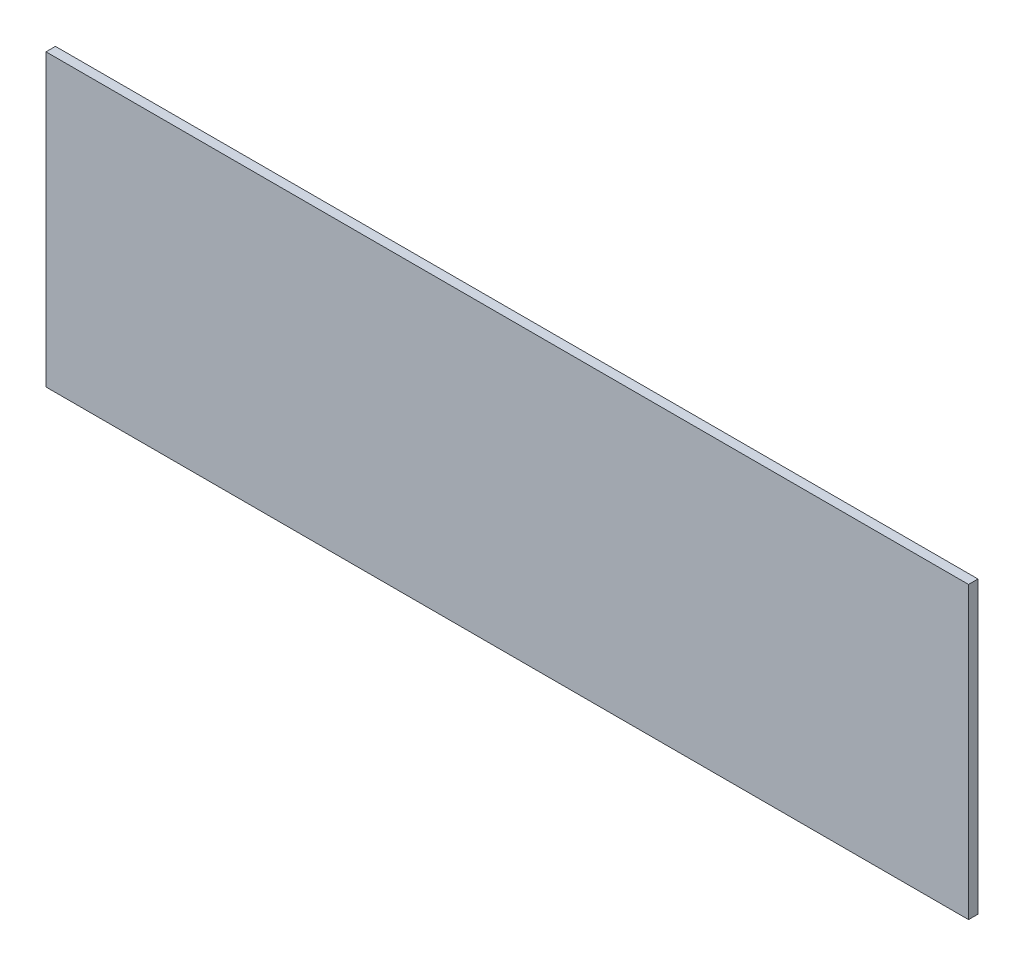
ISO-10303-21;
HEADER;
FILE_DESCRIPTION(('STEP AP214'),'2;1');
FILE_NAME('part.step','',(''),(''),'','','');
FILE_SCHEMA(('AUTOMOTIVE_DESIGN { 1 0 10303 214 1 1 1 1 }'));
ENDSEC;
DATA;
#1=APPLICATION_CONTEXT('core data for automotive mechanical design processes');
#2=APPLICATION_PROTOCOL_DEFINITION('international standard','automotive_design',2000,#1);
#3=PRODUCT_CONTEXT('',#1,'mechanical');
#4=PRODUCT('Part','Part','',(#3));
#5=PRODUCT_RELATED_PRODUCT_CATEGORY('part','',(#4));
#6=PRODUCT_DEFINITION_FORMATION('','',#4);
#7=PRODUCT_DEFINITION_CONTEXT('part definition',#1,'design');
#8=PRODUCT_DEFINITION('design','',#6,#7);
#9=PRODUCT_DEFINITION_SHAPE('','',#8);
#10=(LENGTH_UNIT() NAMED_UNIT(*) SI_UNIT(.MILLI.,.METRE.));
#11=(NAMED_UNIT(*) PLANE_ANGLE_UNIT() SI_UNIT($,.RADIAN.));
#12=(NAMED_UNIT(*) SI_UNIT($,.STERADIAN.) SOLID_ANGLE_UNIT());
#13=UNCERTAINTY_MEASURE_WITH_UNIT(LENGTH_MEASURE(1.E-05),#10,'distance_accuracy_value','');
#14=(GEOMETRIC_REPRESENTATION_CONTEXT(3) GLOBAL_UNCERTAINTY_ASSIGNED_CONTEXT((#13)) GLOBAL_UNIT_ASSIGNED_CONTEXT((#10,
#11,#12)) REPRESENTATION_CONTEXT('',''));
#15=CARTESIAN_POINT('',(0.,0.,0.));
#16=DIRECTION('',(0.,0.,1.));
#17=DIRECTION('',(1.,0.,0.));
#18=AXIS2_PLACEMENT_3D('',#15,#16,#17);
#19=CARTESIAN_POINT('',(73.25,-23.05,1.5));
#20=DIRECTION('',(-1.,0.,0.));
#21=DIRECTION('',(0.,0.,1.));
#22=AXIS2_PLACEMENT_3D('',#19,#20,#21);
#23=PLANE('',#22);
#24=DIRECTION('',(0.,1.,0.));
#25=VECTOR('',#24,1.);
#26=CARTESIAN_POINT('',(73.25,-23.05,0.));
#27=LINE('',#26,#25);
#28=CARTESIAN_POINT('',(73.25,-23.05,0.));
#29=VERTEX_POINT('',#28);
#30=CARTESIAN_POINT('',(73.25,23.05,0.));
#31=VERTEX_POINT('',#30);
#32=EDGE_CURVE('E107',#29,#31,#27,.T.);
#33=ORIENTED_EDGE('',*,*,#32,.T.);
#34=DIRECTION('',(0.,0.,-1.));
#35=VECTOR('',#34,1.);
#36=CARTESIAN_POINT('',(73.25,23.05,1.5));
#37=LINE('',#36,#35);
#38=CARTESIAN_POINT('',(73.25,23.05,1.5));
#39=VERTEX_POINT('',#38);
#40=EDGE_CURVE('E11',#39,#31,#37,.T.);
#41=ORIENTED_EDGE('',*,*,#40,.F.);
#42=DIRECTION('',(0.,1.,0.));
#43=VECTOR('',#42,1.);
#44=CARTESIAN_POINT('',(73.25,-23.05,1.5));
#45=LINE('',#44,#43);
#46=CARTESIAN_POINT('',(73.25,-23.05,1.5));
#47=VERTEX_POINT('',#46);
#48=EDGE_CURVE('E91',#47,#39,#45,.T.);
#49=ORIENTED_EDGE('',*,*,#48,.F.);
#50=DIRECTION('',(0.,0.,-1.));
#51=VECTOR('',#50,1.);
#52=CARTESIAN_POINT('',(73.25,-23.05,1.5));
#53=LINE('',#52,#51);
#54=EDGE_CURVE('E103',#47,#29,#53,.T.);
#55=ORIENTED_EDGE('',*,*,#54,.T.);
#56=EDGE_LOOP('',(#33,#41,#49,#55));
#57=FACE_BOUND('',#56,.T.);
#58=ADVANCED_FACE('F39',(#57),#23,.F.);
#59=CARTESIAN_POINT('',(-73.25,23.05,1.5));
#60=DIRECTION('',(0.,-1.,0.));
#61=DIRECTION('',(0.,0.,-1.));
#62=AXIS2_PLACEMENT_3D('',#59,#60,#61);
#63=PLANE('',#62);
#64=DIRECTION('',(-1.,0.,0.));
#65=VECTOR('',#64,1.);
#66=CARTESIAN_POINT('',(-73.25,23.05,0.));
#67=LINE('',#66,#65);
#68=CARTESIAN_POINT('',(-73.25,23.05,0.));
#69=VERTEX_POINT('',#68);
#70=EDGE_CURVE('E96',#31,#69,#67,.T.);
#71=ORIENTED_EDGE('',*,*,#70,.T.);
#72=DIRECTION('',(0.,0.,-1.));
#73=VECTOR('',#72,1.);
#74=CARTESIAN_POINT('',(-73.25,23.05,1.5));
#75=LINE('',#74,#73);
#76=CARTESIAN_POINT('',(-73.25,23.05,1.5));
#77=VERTEX_POINT('',#76);
#78=EDGE_CURVE('E48',#77,#69,#75,.T.);
#79=ORIENTED_EDGE('',*,*,#78,.F.);
#80=DIRECTION('',(-1.,0.,0.));
#81=VECTOR('',#80,1.);
#82=CARTESIAN_POINT('',(-73.25,23.05,1.5));
#83=LINE('',#82,#81);
#84=EDGE_CURVE('E86',#39,#77,#83,.T.);
#85=ORIENTED_EDGE('',*,*,#84,.F.);
#86=ORIENTED_EDGE('',*,*,#40,.T.);
#87=EDGE_LOOP('',(#71,#79,#85,#86));
#88=FACE_BOUND('',#87,.T.);
#89=ADVANCED_FACE('F95',(#88),#63,.F.);
#90=CARTESIAN_POINT('',(-73.25,-23.05,1.5));
#91=DIRECTION('',(1.,0.,0.));
#92=DIRECTION('',(0.,0.,-1.));
#93=AXIS2_PLACEMENT_3D('',#90,#91,#92);
#94=PLANE('',#93);
#95=DIRECTION('',(0.,-1.,0.));
#96=VECTOR('',#95,1.);
#97=CARTESIAN_POINT('',(-73.25,-23.05,0.));
#98=LINE('',#97,#96);
#99=CARTESIAN_POINT('',(-73.25,-23.05,0.));
#100=VERTEX_POINT('',#99);
#101=EDGE_CURVE('E73',#69,#100,#98,.T.);
#102=ORIENTED_EDGE('',*,*,#101,.T.);
#103=DIRECTION('',(0.,0.,-1.));
#104=VECTOR('',#103,1.);
#105=CARTESIAN_POINT('',(-73.25,-23.05,1.5));
#106=LINE('',#105,#104);
#107=CARTESIAN_POINT('',(-73.25,-23.05,1.5));
#108=VERTEX_POINT('',#107);
#109=EDGE_CURVE('E98',#108,#100,#106,.T.);
#110=ORIENTED_EDGE('',*,*,#109,.F.);
#111=DIRECTION('',(0.,-1.,0.));
#112=VECTOR('',#111,1.);
#113=CARTESIAN_POINT('',(-73.25,-23.05,1.5));
#114=LINE('',#113,#112);
#115=EDGE_CURVE('E89',#77,#108,#114,.T.);
#116=ORIENTED_EDGE('',*,*,#115,.F.);
#117=ORIENTED_EDGE('',*,*,#78,.T.);
#118=EDGE_LOOP('',(#102,#110,#116,#117));
#119=FACE_BOUND('',#118,.T.);
#120=ADVANCED_FACE('F99',(#119),#94,.F.);
#121=CARTESIAN_POINT('',(-73.25,-23.05,1.5));
#122=DIRECTION('',(0.,1.,0.));
#123=DIRECTION('',(0.,0.,1.));
#124=AXIS2_PLACEMENT_3D('',#121,#122,#123);
#125=PLANE('',#124);
#126=DIRECTION('',(1.,0.,0.));
#127=VECTOR('',#126,1.);
#128=CARTESIAN_POINT('',(-73.25,-23.05,0.));
#129=LINE('',#128,#127);
#130=EDGE_CURVE('E79',#100,#29,#129,.T.);
#131=ORIENTED_EDGE('',*,*,#130,.T.);
#132=ORIENTED_EDGE('',*,*,#54,.F.);
#133=DIRECTION('',(1.,0.,0.));
#134=VECTOR('',#133,1.);
#135=CARTESIAN_POINT('',(-73.25,-23.05,1.5));
#136=LINE('',#135,#134);
#137=EDGE_CURVE('E56',#108,#47,#136,.T.);
#138=ORIENTED_EDGE('',*,*,#137,.F.);
#139=ORIENTED_EDGE('',*,*,#109,.T.);
#140=EDGE_LOOP('',(#131,#132,#138,#139));
#141=FACE_BOUND('',#140,.T.);
#142=ADVANCED_FACE('F120',(#141),#125,.F.);
#143=CARTESIAN_POINT('',(0.,0.,1.5));
#144=DIRECTION('',(0.,0.,-1.));
#145=DIRECTION('',(-1.,0.,0.));
#146=AXIS2_PLACEMENT_3D('',#143,#144,#145);
#147=PLANE('',#146);
#148=ORIENTED_EDGE('',*,*,#48,.T.);
#149=ORIENTED_EDGE('',*,*,#84,.T.);
#150=ORIENTED_EDGE('',*,*,#115,.T.);
#151=ORIENTED_EDGE('',*,*,#137,.T.);
#152=EDGE_LOOP('',(#148,#149,#150,#151));
#153=FACE_BOUND('',#152,.T.);
#154=ADVANCED_FACE('F87',(#153),#147,.F.);
#155=CARTESIAN_POINT('',(0.,0.,0.));
#156=DIRECTION('',(0.,0.,-1.));
#157=DIRECTION('',(-1.,0.,0.));
#158=AXIS2_PLACEMENT_3D('',#155,#156,#157);
#159=PLANE('',#158);
#160=ORIENTED_EDGE('',*,*,#32,.F.);
#161=ORIENTED_EDGE('',*,*,#130,.F.);
#162=ORIENTED_EDGE('',*,*,#101,.F.);
#163=ORIENTED_EDGE('',*,*,#70,.F.);
#164=EDGE_LOOP('',(#160,#161,#162,#163));
#165=FACE_BOUND('',#164,.T.);
#166=ADVANCED_FACE('F123',(#165),#159,.T.);
#167=CLOSED_SHELL('',(#58,#89,#120,#142,#154,#166));
#168=MANIFOLD_SOLID_BREP('B2',#167);
#169=ADVANCED_BREP_SHAPE_REPRESENTATION('',(#18,#168),#14);
#170=SHAPE_DEFINITION_REPRESENTATION(#9,#169);
ENDSEC;
END-ISO-10303-21;
